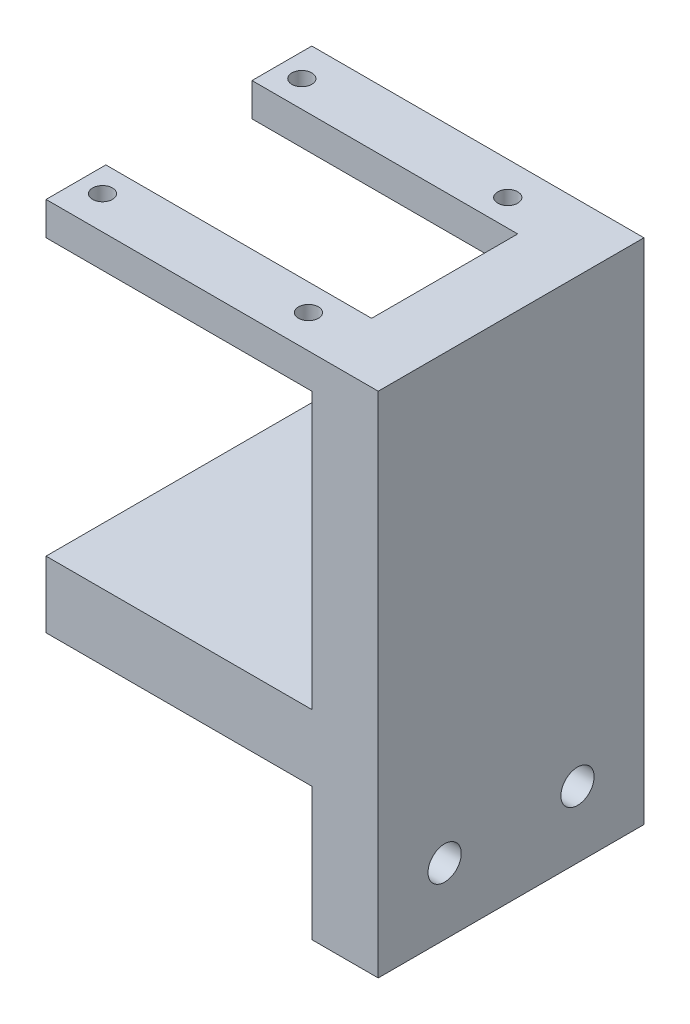
ISO-10303-21;
HEADER;
FILE_DESCRIPTION(('STEP AP214'),'2;1');
FILE_NAME('part.step','',(''),(''),'','','');
FILE_SCHEMA(('AUTOMOTIVE_DESIGN { 1 0 10303 214 1 1 1 1 }'));
ENDSEC;
DATA;
#1=APPLICATION_CONTEXT('core data for automotive mechanical design processes');
#2=APPLICATION_PROTOCOL_DEFINITION('international standard','automotive_design',2000,#1);
#3=PRODUCT_CONTEXT('',#1,'mechanical');
#4=PRODUCT('Part','Part','',(#3));
#5=PRODUCT_RELATED_PRODUCT_CATEGORY('part','',(#4));
#6=PRODUCT_DEFINITION_FORMATION('','',#4);
#7=PRODUCT_DEFINITION_CONTEXT('part definition',#1,'design');
#8=PRODUCT_DEFINITION('design','',#6,#7);
#9=PRODUCT_DEFINITION_SHAPE('','',#8);
#10=(LENGTH_UNIT() NAMED_UNIT(*) SI_UNIT(.MILLI.,.METRE.));
#11=(NAMED_UNIT(*) PLANE_ANGLE_UNIT() SI_UNIT($,.RADIAN.));
#12=(NAMED_UNIT(*) SI_UNIT($,.STERADIAN.) SOLID_ANGLE_UNIT());
#13=UNCERTAINTY_MEASURE_WITH_UNIT(LENGTH_MEASURE(1.E-05),#10,'distance_accuracy_value','');
#14=(GEOMETRIC_REPRESENTATION_CONTEXT(3) GLOBAL_UNCERTAINTY_ASSIGNED_CONTEXT((#13)) GLOBAL_UNIT_ASSIGNED_CONTEXT((#10,
#11,#12)) REPRESENTATION_CONTEXT('',''));
#15=CARTESIAN_POINT('',(0.,0.,0.));
#16=DIRECTION('',(0.,0.,1.));
#17=DIRECTION('',(1.,0.,0.));
#18=AXIS2_PLACEMENT_3D('',#15,#16,#17);
#19=CARTESIAN_POINT('',(0.,0.,0.));
#20=DIRECTION('',(1.,0.,0.));
#21=DIRECTION('',(0.,0.,-1.));
#22=AXIS2_PLACEMENT_3D('',#19,#20,#21);
#23=PLANE('',#22);
#24=DIRECTION('',(0.,0.,-1.));
#25=VECTOR('',#24,1.);
#26=CARTESIAN_POINT('',(0.,51.5,20.));
#27=LINE('',#26,#25);
#28=CARTESIAN_POINT('',(0.,51.5,20.));
#29=VERTEX_POINT('',#28);
#30=CARTESIAN_POINT('',(0.,51.5,11.));
#31=VERTEX_POINT('',#30);
#32=EDGE_CURVE('E64',#29,#31,#27,.T.);
#33=ORIENTED_EDGE('',*,*,#32,.T.);
#34=DIRECTION('',(0.,1.,0.));
#35=VECTOR('',#34,1.);
#36=CARTESIAN_POINT('',(0.,56.5,11.));
#37=LINE('',#36,#35);
#38=CARTESIAN_POINT('',(0.,56.5,11.));
#39=VERTEX_POINT('',#38);
#40=EDGE_CURVE('E184',#31,#39,#37,.T.);
#41=ORIENTED_EDGE('',*,*,#40,.T.);
#42=DIRECTION('',(0.,0.,-1.));
#43=VECTOR('',#42,1.);
#44=CARTESIAN_POINT('',(0.,56.5,0.));
#45=LINE('',#44,#43);
#46=CARTESIAN_POINT('',(0.,56.5,-11.));
#47=VERTEX_POINT('',#46);
#48=EDGE_CURVE('E308',#39,#47,#45,.T.);
#49=ORIENTED_EDGE('',*,*,#48,.T.);
#50=DIRECTION('',(0.,1.,0.));
#51=VECTOR('',#50,1.);
#52=CARTESIAN_POINT('',(0.,56.5,-11.));
#53=LINE('',#52,#51);
#54=CARTESIAN_POINT('',(0.,51.5,-11.));
#55=VERTEX_POINT('',#54);
#56=EDGE_CURVE('E72',#55,#47,#53,.T.);
#57=ORIENTED_EDGE('',*,*,#56,.F.);
#58=DIRECTION('',(0.,0.,1.));
#59=VECTOR('',#58,1.);
#60=CARTESIAN_POINT('',(0.,51.5,-20.));
#61=LINE('',#60,#59);
#62=CARTESIAN_POINT('',(0.,51.5,-20.));
#63=VERTEX_POINT('',#62);
#64=EDGE_CURVE('E208',#63,#55,#61,.T.);
#65=ORIENTED_EDGE('',*,*,#64,.F.);
#66=DIRECTION('',(0.,-1.,0.));
#67=VECTOR('',#66,1.);
#68=CARTESIAN_POINT('',(0.,0.,-20.));
#69=LINE('',#68,#67);
#70=CARTESIAN_POINT('',(0.,10.,-20.));
#71=VERTEX_POINT('',#70);
#72=EDGE_CURVE('E305',#63,#71,#69,.T.);
#73=ORIENTED_EDGE('',*,*,#72,.T.);
#74=DIRECTION('',(0.,0.,-1.));
#75=VECTOR('',#74,1.);
#76=CARTESIAN_POINT('',(0.,10.,-20.));
#77=LINE('',#76,#75);
#78=CARTESIAN_POINT('',(0.,10.,20.));
#79=VERTEX_POINT('',#78);
#80=EDGE_CURVE('E245',#79,#71,#77,.T.);
#81=ORIENTED_EDGE('',*,*,#80,.F.);
#82=DIRECTION('',(0.,-1.,0.));
#83=VECTOR('',#82,1.);
#84=CARTESIAN_POINT('',(0.,0.,20.));
#85=LINE('',#84,#83);
#86=EDGE_CURVE('E312',#29,#79,#85,.T.);
#87=ORIENTED_EDGE('',*,*,#86,.F.);
#88=EDGE_LOOP('',(#33,#41,#49,#57,#65,#73,#81,#87));
#89=FACE_BOUND('',#88,.T.);
#90=ADVANCED_FACE('F48',(#89),#23,.F.);
#91=CARTESIAN_POINT('',(0.,-10.,10.));
#92=DIRECTION('',(1.,0.,0.));
#93=DIRECTION('',(0.,0.,-1.));
#94=AXIS2_PLACEMENT_3D('',#91,#92,#93);
#95=CIRCLE('',#94,2.5);
#96=CARTESIAN_POINT('',(0.,-10.,7.5));
#97=VERTEX_POINT('',#96);
#98=EDGE_CURVE('E288',#97,#97,#95,.T.);
#99=ORIENTED_EDGE('',*,*,#98,.T.);
#100=EDGE_LOOP('',(#99));
#101=FACE_BOUND('',#100,.T.);
#102=CARTESIAN_POINT('',(0.,-10.,-10.));
#103=DIRECTION('',(1.,0.,0.));
#104=DIRECTION('',(0.,0.,-1.));
#105=AXIS2_PLACEMENT_3D('',#102,#103,#104);
#106=CIRCLE('',#105,2.5);
#107=CARTESIAN_POINT('',(0.,-10.,-12.5));
#108=VERTEX_POINT('',#107);
#109=EDGE_CURVE('E319',#108,#108,#106,.T.);
#110=ORIENTED_EDGE('',*,*,#109,.T.);
#111=EDGE_LOOP('',(#110));
#112=FACE_BOUND('',#111,.T.);
#113=DIRECTION('',(0.,0.,1.));
#114=VECTOR('',#113,1.);
#115=CARTESIAN_POINT('',(0.,0.,-20.));
#116=LINE('',#115,#114);
#117=CARTESIAN_POINT('',(0.,0.,-20.));
#118=VERTEX_POINT('',#117);
#119=CARTESIAN_POINT('',(0.,0.,20.));
#120=VERTEX_POINT('',#119);
#121=EDGE_CURVE('E251',#118,#120,#116,.T.);
#122=ORIENTED_EDGE('',*,*,#121,.F.);
#123=CARTESIAN_POINT('',(0.,-20.,-20.));
#124=VERTEX_POINT('',#123);
#125=EDGE_CURVE('E282',#118,#124,#69,.T.);
#126=ORIENTED_EDGE('',*,*,#125,.T.);
#127=DIRECTION('',(0.,0.,-1.));
#128=VECTOR('',#127,1.);
#129=CARTESIAN_POINT('',(0.,-20.,0.));
#130=LINE('',#129,#128);
#131=CARTESIAN_POINT('',(0.,-20.,20.));
#132=VERTEX_POINT('',#131);
#133=EDGE_CURVE('E315',#132,#124,#130,.T.);
#134=ORIENTED_EDGE('',*,*,#133,.F.);
#135=EDGE_CURVE('E311',#120,#132,#85,.T.);
#136=ORIENTED_EDGE('',*,*,#135,.F.);
#137=EDGE_LOOP('',(#122,#126,#134,#136));
#138=FACE_BOUND('',#137,.T.);
#139=ADVANCED_FACE('F337',(#101,#112,#138),#23,.F.);
#140=CARTESIAN_POINT('',(10.,0.,-20.));
#141=DIRECTION('',(0.,0.,-1.));
#142=DIRECTION('',(0.,1.,0.));
#143=AXIS2_PLACEMENT_3D('',#140,#141,#142);
#144=PLANE('',#143);
#145=ORIENTED_EDGE('',*,*,#72,.F.);
#146=DIRECTION('',(1.,0.,0.));
#147=VECTOR('',#146,1.);
#148=CARTESIAN_POINT('',(-40.,51.5,-20.));
#149=LINE('',#148,#147);
#150=CARTESIAN_POINT('',(-40.,51.5,-20.));
#151=VERTEX_POINT('',#150);
#152=EDGE_CURVE('E241',#151,#63,#149,.T.);
#153=ORIENTED_EDGE('',*,*,#152,.F.);
#154=DIRECTION('',(0.,-1.,0.));
#155=VECTOR('',#154,1.);
#156=CARTESIAN_POINT('',(-40.,56.5,-20.));
#157=LINE('',#156,#155);
#158=CARTESIAN_POINT('',(-40.,56.5,-20.));
#159=VERTEX_POINT('',#158);
#160=EDGE_CURVE('E215',#159,#151,#157,.T.);
#161=ORIENTED_EDGE('',*,*,#160,.F.);
#162=DIRECTION('',(-1.,0.,0.));
#163=VECTOR('',#162,1.);
#164=CARTESIAN_POINT('',(10.,56.5,-20.));
#165=LINE('',#164,#163);
#166=CARTESIAN_POINT('',(10.,56.5,-20.));
#167=VERTEX_POINT('',#166);
#168=EDGE_CURVE('E11',#167,#159,#165,.T.);
#169=ORIENTED_EDGE('',*,*,#168,.F.);
#170=DIRECTION('',(0.,-1.,0.));
#171=VECTOR('',#170,1.);
#172=CARTESIAN_POINT('',(10.,0.,-20.));
#173=LINE('',#172,#171);
#174=CARTESIAN_POINT('',(10.,-20.,-20.));
#175=VERTEX_POINT('',#174);
#176=EDGE_CURVE('E283',#167,#175,#173,.T.);
#177=ORIENTED_EDGE('',*,*,#176,.T.);
#178=DIRECTION('',(-1.,0.,0.));
#179=VECTOR('',#178,1.);
#180=CARTESIAN_POINT('',(10.,-20.,-20.));
#181=LINE('',#180,#179);
#182=EDGE_CURVE('E304',#175,#124,#181,.T.);
#183=ORIENTED_EDGE('',*,*,#182,.T.);
#184=ORIENTED_EDGE('',*,*,#125,.F.);
#185=DIRECTION('',(1.,0.,0.));
#186=VECTOR('',#185,1.);
#187=CARTESIAN_POINT('',(-40.,0.,-20.));
#188=LINE('',#187,#186);
#189=CARTESIAN_POINT('',(-40.,0.,-20.));
#190=VERTEX_POINT('',#189);
#191=EDGE_CURVE('E270',#190,#118,#188,.T.);
#192=ORIENTED_EDGE('',*,*,#191,.F.);
#193=DIRECTION('',(0.,-1.,0.));
#194=VECTOR('',#193,1.);
#195=CARTESIAN_POINT('',(-40.,10.,-20.));
#196=LINE('',#195,#194);
#197=CARTESIAN_POINT('',(-40.,10.,-20.));
#198=VERTEX_POINT('',#197);
#199=EDGE_CURVE('E254',#198,#190,#196,.T.);
#200=ORIENTED_EDGE('',*,*,#199,.F.);
#201=DIRECTION('',(1.,0.,0.));
#202=VECTOR('',#201,1.);
#203=CARTESIAN_POINT('',(-40.,10.,-20.));
#204=LINE('',#203,#202);
#205=EDGE_CURVE('E274',#198,#71,#204,.T.);
#206=ORIENTED_EDGE('',*,*,#205,.T.);
#207=EDGE_LOOP('',(#145,#153,#161,#169,#177,#183,#184,#192,#200,#206));
#208=FACE_BOUND('',#207,.T.);
#209=ADVANCED_FACE('F50',(#208),#144,.T.);
#210=CARTESIAN_POINT('',(10.,56.5,0.));
#211=DIRECTION('',(0.,1.,0.));
#212=DIRECTION('',(0.,0.,1.));
#213=AXIS2_PLACEMENT_3D('',#210,#211,#212);
#214=PLANE('',#213);
#215=CARTESIAN_POINT('',(-36.5,56.5,15.));
#216=DIRECTION('',(0.,-1.,0.));
#217=DIRECTION('',(0.,0.,-1.));
#218=AXIS2_PLACEMENT_3D('',#215,#216,#217);
#219=CIRCLE('',#218,1.5);
#220=CARTESIAN_POINT('',(-36.5,56.5,13.5));
#221=VERTEX_POINT('',#220);
#222=EDGE_CURVE('E412',#221,#221,#219,.T.);
#223=ORIENTED_EDGE('',*,*,#222,.T.);
#224=EDGE_LOOP('',(#223));
#225=FACE_BOUND('',#224,.T.);
#226=CARTESIAN_POINT('',(-5.5,56.5,15.));
#227=DIRECTION('',(0.,-1.,0.));
#228=DIRECTION('',(0.,0.,-1.));
#229=AXIS2_PLACEMENT_3D('',#226,#227,#228);
#230=CIRCLE('',#229,1.5);
#231=CARTESIAN_POINT('',(-5.5,56.5,13.5));
#232=VERTEX_POINT('',#231);
#233=EDGE_CURVE('E416',#232,#232,#230,.T.);
#234=ORIENTED_EDGE('',*,*,#233,.T.);
#235=EDGE_LOOP('',(#234));
#236=FACE_BOUND('',#235,.T.);
#237=CARTESIAN_POINT('',(-36.5,56.5,-15.));
#238=DIRECTION('',(0.,1.,0.));
#239=DIRECTION('',(0.,0.,1.));
#240=AXIS2_PLACEMENT_3D('',#237,#238,#239);
#241=CIRCLE('',#240,1.5);
#242=CARTESIAN_POINT('',(-36.5,56.5,-13.5));
#243=VERTEX_POINT('',#242);
#244=EDGE_CURVE('E203',#243,#243,#241,.T.);
#245=ORIENTED_EDGE('',*,*,#244,.F.);
#246=EDGE_LOOP('',(#245));
#247=FACE_BOUND('',#246,.T.);
#248=CARTESIAN_POINT('',(-5.5,56.5,-15.));
#249=DIRECTION('',(0.,1.,0.));
#250=DIRECTION('',(0.,0.,1.));
#251=AXIS2_PLACEMENT_3D('',#248,#249,#250);
#252=CIRCLE('',#251,1.5);
#253=CARTESIAN_POINT('',(-5.5,56.5,-13.5));
#254=VERTEX_POINT('',#253);
#255=EDGE_CURVE('E198',#254,#254,#252,.T.);
#256=ORIENTED_EDGE('',*,*,#255,.F.);
#257=EDGE_LOOP('',(#256));
#258=FACE_BOUND('',#257,.T.);
#259=ORIENTED_EDGE('',*,*,#48,.F.);
#260=DIRECTION('',(1.,0.,0.));
#261=VECTOR('',#260,1.);
#262=CARTESIAN_POINT('',(-40.,56.5,11.));
#263=LINE('',#262,#261);
#264=CARTESIAN_POINT('',(-40.,56.5,11.));
#265=VERTEX_POINT('',#264);
#266=EDGE_CURVE('E173',#265,#39,#263,.T.);
#267=ORIENTED_EDGE('',*,*,#266,.F.);
#268=DIRECTION('',(0.,0.,1.));
#269=VECTOR('',#268,1.);
#270=CARTESIAN_POINT('',(-40.,56.5,20.));
#271=LINE('',#270,#269);
#272=CARTESIAN_POINT('',(-40.,56.5,20.));
#273=VERTEX_POINT('',#272);
#274=EDGE_CURVE('E165',#265,#273,#271,.T.);
#275=ORIENTED_EDGE('',*,*,#274,.T.);
#276=DIRECTION('',(-1.,0.,0.));
#277=VECTOR('',#276,1.);
#278=CARTESIAN_POINT('',(10.,56.5,20.));
#279=LINE('',#278,#277);
#280=CARTESIAN_POINT('',(10.,56.5,20.));
#281=VERTEX_POINT('',#280);
#282=EDGE_CURVE('E57',#281,#273,#279,.T.);
#283=ORIENTED_EDGE('',*,*,#282,.F.);
#284=DIRECTION('',(0.,0.,-1.));
#285=VECTOR('',#284,1.);
#286=CARTESIAN_POINT('',(10.,56.5,0.));
#287=LINE('',#286,#285);
#288=EDGE_CURVE('E287',#281,#167,#287,.T.);
#289=ORIENTED_EDGE('',*,*,#288,.T.);
#290=ORIENTED_EDGE('',*,*,#168,.T.);
#291=DIRECTION('',(0.,0.,-1.));
#292=VECTOR('',#291,1.);
#293=CARTESIAN_POINT('',(-40.,56.5,-20.));
#294=LINE('',#293,#292);
#295=CARTESIAN_POINT('',(-40.,56.5,-11.));
#296=VERTEX_POINT('',#295);
#297=EDGE_CURVE('E225',#296,#159,#294,.T.);
#298=ORIENTED_EDGE('',*,*,#297,.F.);
#299=DIRECTION('',(1.,0.,0.));
#300=VECTOR('',#299,1.);
#301=CARTESIAN_POINT('',(-40.,56.5,-11.));
#302=LINE('',#301,#300);
#303=EDGE_CURVE('E229',#296,#47,#302,.T.);
#304=ORIENTED_EDGE('',*,*,#303,.T.);
#305=EDGE_LOOP('',(#259,#267,#275,#283,#289,#290,#298,#304));
#306=FACE_BOUND('',#305,.T.);
#307=ADVANCED_FACE('F172',(#225,#236,#247,#258,#306),#214,.T.);
#308=CARTESIAN_POINT('',(10.,0.,20.));
#309=DIRECTION('',(0.,0.,-1.));
#310=DIRECTION('',(0.,1.,0.));
#311=AXIS2_PLACEMENT_3D('',#308,#309,#310);
#312=PLANE('',#311);
#313=ORIENTED_EDGE('',*,*,#282,.T.);
#314=DIRECTION('',(0.,-1.,0.));
#315=VECTOR('',#314,1.);
#316=CARTESIAN_POINT('',(-40.,56.5,20.));
#317=LINE('',#316,#315);
#318=CARTESIAN_POINT('',(-40.,51.5,20.));
#319=VERTEX_POINT('',#318);
#320=EDGE_CURVE('E151',#273,#319,#317,.T.);
#321=ORIENTED_EDGE('',*,*,#320,.T.);
#322=DIRECTION('',(1.,0.,0.));
#323=VECTOR('',#322,1.);
#324=CARTESIAN_POINT('',(-40.,51.5,20.));
#325=LINE('',#324,#323);
#326=EDGE_CURVE('E183',#319,#29,#325,.T.);
#327=ORIENTED_EDGE('',*,*,#326,.T.);
#328=ORIENTED_EDGE('',*,*,#86,.T.);
#329=DIRECTION('',(1.,0.,0.));
#330=VECTOR('',#329,1.);
#331=CARTESIAN_POINT('',(-40.,10.,20.));
#332=LINE('',#331,#330);
#333=CARTESIAN_POINT('',(-40.,10.,20.));
#334=VERTEX_POINT('',#333);
#335=EDGE_CURVE('E278',#334,#79,#332,.T.);
#336=ORIENTED_EDGE('',*,*,#335,.F.);
#337=DIRECTION('',(0.,1.,0.));
#338=VECTOR('',#337,1.);
#339=CARTESIAN_POINT('',(-40.,10.,20.));
#340=LINE('',#339,#338);
#341=CARTESIAN_POINT('',(-40.,0.,20.));
#342=VERTEX_POINT('',#341);
#343=EDGE_CURVE('E246',#342,#334,#340,.T.);
#344=ORIENTED_EDGE('',*,*,#343,.F.);
#345=DIRECTION('',(1.,0.,0.));
#346=VECTOR('',#345,1.);
#347=CARTESIAN_POINT('',(-40.,0.,20.));
#348=LINE('',#347,#346);
#349=EDGE_CURVE('E260',#342,#120,#348,.T.);
#350=ORIENTED_EDGE('',*,*,#349,.T.);
#351=ORIENTED_EDGE('',*,*,#135,.T.);
#352=DIRECTION('',(-1.,0.,0.));
#353=VECTOR('',#352,1.);
#354=CARTESIAN_POINT('',(10.,-20.,20.));
#355=LINE('',#354,#353);
#356=CARTESIAN_POINT('',(10.,-20.,20.));
#357=VERTEX_POINT('',#356);
#358=EDGE_CURVE('E160',#357,#132,#355,.T.);
#359=ORIENTED_EDGE('',*,*,#358,.F.);
#360=DIRECTION('',(0.,-1.,0.));
#361=VECTOR('',#360,1.);
#362=CARTESIAN_POINT('',(10.,0.,20.));
#363=LINE('',#362,#361);
#364=EDGE_CURVE('E154',#281,#357,#363,.T.);
#365=ORIENTED_EDGE('',*,*,#364,.F.);
#366=EDGE_LOOP('',(#313,#321,#327,#328,#336,#344,#350,#351,#359,#365));
#367=FACE_BOUND('',#366,.T.);
#368=ADVANCED_FACE('F150',(#367),#312,.F.);
#369=CARTESIAN_POINT('',(10.,-10.,-10.));
#370=DIRECTION('',(-1.,0.,0.));
#371=DIRECTION('',(0.,0.,1.));
#372=AXIS2_PLACEMENT_3D('',#369,#370,#371);
#373=CYLINDRICAL_SURFACE('',#372,2.5);
#374=CARTESIAN_POINT('',(10.,-10.,-10.));
#375=DIRECTION('',(1.,0.,0.));
#376=DIRECTION('',(0.,0.,-1.));
#377=AXIS2_PLACEMENT_3D('',#374,#375,#376);
#378=CIRCLE('',#377,2.5);
#379=CARTESIAN_POINT('',(10.,-10.,-12.5));
#380=VERTEX_POINT('',#379);
#381=EDGE_CURVE('E296',#380,#380,#378,.T.);
#382=ORIENTED_EDGE('',*,*,#381,.T.);
#383=EDGE_LOOP('',(#382));
#384=FACE_BOUND('',#383,.T.);
#385=ORIENTED_EDGE('',*,*,#109,.F.);
#386=EDGE_LOOP('',(#385));
#387=FACE_BOUND('',#386,.T.);
#388=ADVANCED_FACE('F397',(#384,#387),#373,.F.);
#389=CARTESIAN_POINT('',(10.,-20.,0.));
#390=DIRECTION('',(0.,1.,0.));
#391=DIRECTION('',(0.,0.,1.));
#392=AXIS2_PLACEMENT_3D('',#389,#390,#391);
#393=PLANE('',#392);
#394=ORIENTED_EDGE('',*,*,#133,.T.);
#395=ORIENTED_EDGE('',*,*,#182,.F.);
#396=DIRECTION('',(0.,0.,-1.));
#397=VECTOR('',#396,1.);
#398=CARTESIAN_POINT('',(10.,-20.,0.));
#399=LINE('',#398,#397);
#400=EDGE_CURVE('E293',#357,#175,#399,.T.);
#401=ORIENTED_EDGE('',*,*,#400,.F.);
#402=ORIENTED_EDGE('',*,*,#358,.T.);
#403=EDGE_LOOP('',(#394,#395,#401,#402));
#404=FACE_BOUND('',#403,.T.);
#405=ADVANCED_FACE('F334',(#404),#393,.F.);
#406=CARTESIAN_POINT('',(10.,-10.,10.));
#407=DIRECTION('',(-1.,0.,0.));
#408=DIRECTION('',(0.,0.,1.));
#409=AXIS2_PLACEMENT_3D('',#406,#407,#408);
#410=CYLINDRICAL_SURFACE('',#409,2.5);
#411=CARTESIAN_POINT('',(10.,-10.,10.));
#412=DIRECTION('',(1.,0.,0.));
#413=DIRECTION('',(0.,0.,-1.));
#414=AXIS2_PLACEMENT_3D('',#411,#412,#413);
#415=CIRCLE('',#414,2.5);
#416=CARTESIAN_POINT('',(10.,-10.,7.5));
#417=VERTEX_POINT('',#416);
#418=EDGE_CURVE('E300',#417,#417,#415,.T.);
#419=ORIENTED_EDGE('',*,*,#418,.T.);
#420=EDGE_LOOP('',(#419));
#421=FACE_BOUND('',#420,.T.);
#422=ORIENTED_EDGE('',*,*,#98,.F.);
#423=EDGE_LOOP('',(#422));
#424=FACE_BOUND('',#423,.T.);
#425=ADVANCED_FACE('F393',(#421,#424),#410,.F.);
#426=CARTESIAN_POINT('',(10.,0.,0.));
#427=DIRECTION('',(1.,0.,0.));
#428=DIRECTION('',(0.,0.,-1.));
#429=AXIS2_PLACEMENT_3D('',#426,#427,#428);
#430=PLANE('',#429);
#431=ORIENTED_EDGE('',*,*,#176,.F.);
#432=ORIENTED_EDGE('',*,*,#288,.F.);
#433=ORIENTED_EDGE('',*,*,#364,.T.);
#434=ORIENTED_EDGE('',*,*,#400,.T.);
#435=EDGE_LOOP('',(#431,#432,#433,#434));
#436=FACE_BOUND('',#435,.T.);
#437=ORIENTED_EDGE('',*,*,#381,.F.);
#438=EDGE_LOOP('',(#437));
#439=FACE_BOUND('',#438,.T.);
#440=ORIENTED_EDGE('',*,*,#418,.F.);
#441=EDGE_LOOP('',(#440));
#442=FACE_BOUND('',#441,.T.);
#443=ADVANCED_FACE('F346',(#436,#439,#442),#430,.T.);
#444=CARTESIAN_POINT('',(-40.,10.,-20.));
#445=DIRECTION('',(0.,-1.,0.));
#446=DIRECTION('',(0.,0.,-1.));
#447=AXIS2_PLACEMENT_3D('',#444,#445,#446);
#448=PLANE('',#447);
#449=ORIENTED_EDGE('',*,*,#80,.T.);
#450=ORIENTED_EDGE('',*,*,#205,.F.);
#451=DIRECTION('',(0.,0.,-1.));
#452=VECTOR('',#451,1.);
#453=CARTESIAN_POINT('',(-40.,10.,-20.));
#454=LINE('',#453,#452);
#455=EDGE_CURVE('E250',#334,#198,#454,.T.);
#456=ORIENTED_EDGE('',*,*,#455,.F.);
#457=ORIENTED_EDGE('',*,*,#335,.T.);
#458=EDGE_LOOP('',(#449,#450,#456,#457));
#459=FACE_BOUND('',#458,.T.);
#460=ADVANCED_FACE('F368',(#459),#448,.F.);
#461=CARTESIAN_POINT('',(-40.,0.,-20.));
#462=DIRECTION('',(0.,1.,0.));
#463=DIRECTION('',(0.,0.,1.));
#464=AXIS2_PLACEMENT_3D('',#461,#462,#463);
#465=PLANE('',#464);
#466=ORIENTED_EDGE('',*,*,#121,.T.);
#467=ORIENTED_EDGE('',*,*,#349,.F.);
#468=DIRECTION('',(0.,0.,1.));
#469=VECTOR('',#468,1.);
#470=CARTESIAN_POINT('',(-40.,0.,-20.));
#471=LINE('',#470,#469);
#472=EDGE_CURVE('E257',#190,#342,#471,.T.);
#473=ORIENTED_EDGE('',*,*,#472,.F.);
#474=ORIENTED_EDGE('',*,*,#191,.T.);
#475=EDGE_LOOP('',(#466,#467,#473,#474));
#476=FACE_BOUND('',#475,.T.);
#477=ADVANCED_FACE('F376',(#476),#465,.F.);
#478=CARTESIAN_POINT('',(-40.,0.,0.));
#479=DIRECTION('',(-1.,0.,0.));
#480=DIRECTION('',(0.,0.,1.));
#481=AXIS2_PLACEMENT_3D('',#478,#479,#480);
#482=PLANE('',#481);
#483=ORIENTED_EDGE('',*,*,#343,.T.);
#484=ORIENTED_EDGE('',*,*,#455,.T.);
#485=ORIENTED_EDGE('',*,*,#199,.T.);
#486=ORIENTED_EDGE('',*,*,#472,.T.);
#487=EDGE_LOOP('',(#483,#484,#485,#486));
#488=FACE_BOUND('',#487,.T.);
#489=ADVANCED_FACE('F372',(#488),#482,.T.);
#490=CARTESIAN_POINT('',(-40.,51.5,-20.));
#491=DIRECTION('',(0.,1.,0.));
#492=DIRECTION('',(0.,0.,1.));
#493=AXIS2_PLACEMENT_3D('',#490,#491,#492);
#494=PLANE('',#493);
#495=CARTESIAN_POINT('',(-36.5,51.5,-15.));
#496=DIRECTION('',(0.,1.,0.));
#497=DIRECTION('',(0.,0.,1.));
#498=AXIS2_PLACEMENT_3D('',#495,#496,#497);
#499=CIRCLE('',#498,1.5);
#500=CARTESIAN_POINT('',(-36.5,51.5,-13.5));
#501=VERTEX_POINT('',#500);
#502=EDGE_CURVE('E199',#501,#501,#499,.F.);
#503=ORIENTED_EDGE('',*,*,#502,.F.);
#504=EDGE_LOOP('',(#503));
#505=FACE_BOUND('',#504,.T.);
#506=CARTESIAN_POINT('',(-5.5,51.5,-15.));
#507=DIRECTION('',(0.,1.,0.));
#508=DIRECTION('',(0.,0.,1.));
#509=AXIS2_PLACEMENT_3D('',#506,#507,#508);
#510=CIRCLE('',#509,1.5);
#511=CARTESIAN_POINT('',(-5.5,51.5,-13.5));
#512=VERTEX_POINT('',#511);
#513=EDGE_CURVE('E204',#512,#512,#510,.F.);
#514=ORIENTED_EDGE('',*,*,#513,.F.);
#515=EDGE_LOOP('',(#514));
#516=FACE_BOUND('',#515,.T.);
#517=ORIENTED_EDGE('',*,*,#64,.T.);
#518=DIRECTION('',(1.,0.,0.));
#519=VECTOR('',#518,1.);
#520=CARTESIAN_POINT('',(-40.,51.5,-11.));
#521=LINE('',#520,#519);
#522=CARTESIAN_POINT('',(-40.,51.5,-11.));
#523=VERTEX_POINT('',#522);
#524=EDGE_CURVE('E237',#523,#55,#521,.T.);
#525=ORIENTED_EDGE('',*,*,#524,.F.);
#526=DIRECTION('',(0.,0.,1.));
#527=VECTOR('',#526,1.);
#528=CARTESIAN_POINT('',(-40.,51.5,-20.));
#529=LINE('',#528,#527);
#530=EDGE_CURVE('E219',#151,#523,#529,.T.);
#531=ORIENTED_EDGE('',*,*,#530,.F.);
#532=ORIENTED_EDGE('',*,*,#152,.T.);
#533=EDGE_LOOP('',(#517,#525,#531,#532));
#534=FACE_BOUND('',#533,.T.);
#535=ADVANCED_FACE('F355',(#505,#516,#534),#494,.F.);
#536=CARTESIAN_POINT('',(-40.,56.5,-11.));
#537=DIRECTION('',(0.,0.,-1.));
#538=DIRECTION('',(-1.,0.,0.));
#539=AXIS2_PLACEMENT_3D('',#536,#537,#538);
#540=PLANE('',#539);
#541=ORIENTED_EDGE('',*,*,#56,.T.);
#542=ORIENTED_EDGE('',*,*,#303,.F.);
#543=DIRECTION('',(0.,1.,0.));
#544=VECTOR('',#543,1.);
#545=CARTESIAN_POINT('',(-40.,56.5,-11.));
#546=LINE('',#545,#544);
#547=EDGE_CURVE('E222',#523,#296,#546,.T.);
#548=ORIENTED_EDGE('',*,*,#547,.F.);
#549=ORIENTED_EDGE('',*,*,#524,.T.);
#550=EDGE_LOOP('',(#541,#542,#548,#549));
#551=FACE_BOUND('',#550,.T.);
#552=ADVANCED_FACE('F358',(#551),#540,.F.);
#553=CARTESIAN_POINT('',(-40.,0.,0.));
#554=DIRECTION('',(-1.,0.,0.));
#555=DIRECTION('',(0.,0.,1.));
#556=AXIS2_PLACEMENT_3D('',#553,#554,#555);
#557=PLANE('',#556);
#558=ORIENTED_EDGE('',*,*,#160,.T.);
#559=ORIENTED_EDGE('',*,*,#530,.T.);
#560=ORIENTED_EDGE('',*,*,#547,.T.);
#561=ORIENTED_EDGE('',*,*,#297,.T.);
#562=EDGE_LOOP('',(#558,#559,#560,#561));
#563=FACE_BOUND('',#562,.T.);
#564=ADVANCED_FACE('F350',(#563),#557,.T.);
#565=CARTESIAN_POINT('',(-5.5,-20.001,-15.));
#566=DIRECTION('',(0.,1.,0.));
#567=DIRECTION('',(0.,0.,1.));
#568=AXIS2_PLACEMENT_3D('',#565,#566,#567);
#569=CYLINDRICAL_SURFACE('',#568,1.5);
#570=ORIENTED_EDGE('',*,*,#255,.T.);
#571=EDGE_LOOP('',(#570));
#572=FACE_BOUND('',#571,.T.);
#573=ORIENTED_EDGE('',*,*,#513,.T.);
#574=EDGE_LOOP('',(#573));
#575=FACE_BOUND('',#574,.T.);
#576=ADVANCED_FACE('F421',(#572,#575),#569,.F.);
#577=CARTESIAN_POINT('',(-36.5,-20.001,-15.));
#578=DIRECTION('',(0.,1.,0.));
#579=DIRECTION('',(0.,0.,1.));
#580=AXIS2_PLACEMENT_3D('',#577,#578,#579);
#581=CYLINDRICAL_SURFACE('',#580,1.5);
#582=ORIENTED_EDGE('',*,*,#244,.T.);
#583=EDGE_LOOP('',(#582));
#584=FACE_BOUND('',#583,.T.);
#585=ORIENTED_EDGE('',*,*,#502,.T.);
#586=EDGE_LOOP('',(#585));
#587=FACE_BOUND('',#586,.T.);
#588=ADVANCED_FACE('F424',(#584,#587),#581,.F.);
#589=CARTESIAN_POINT('',(-40.,56.5,11.));
#590=DIRECTION('',(0.,0.,-1.));
#591=DIRECTION('',(-1.,0.,0.));
#592=AXIS2_PLACEMENT_3D('',#589,#590,#591);
#593=PLANE('',#592);
#594=ORIENTED_EDGE('',*,*,#40,.F.);
#595=DIRECTION('',(1.,0.,0.));
#596=VECTOR('',#595,1.);
#597=CARTESIAN_POINT('',(-40.,51.5,11.));
#598=LINE('',#597,#596);
#599=CARTESIAN_POINT('',(-40.,51.5,11.));
#600=VERTEX_POINT('',#599);
#601=EDGE_CURVE('E193',#600,#31,#598,.T.);
#602=ORIENTED_EDGE('',*,*,#601,.F.);
#603=DIRECTION('',(0.,1.,0.));
#604=VECTOR('',#603,1.);
#605=CARTESIAN_POINT('',(-40.,56.5,11.));
#606=LINE('',#605,#604);
#607=EDGE_CURVE('E175',#600,#265,#606,.T.);
#608=ORIENTED_EDGE('',*,*,#607,.T.);
#609=ORIENTED_EDGE('',*,*,#266,.T.);
#610=EDGE_LOOP('',(#594,#602,#608,#609));
#611=FACE_BOUND('',#610,.T.);
#612=ADVANCED_FACE('F362',(#611),#593,.T.);
#613=CARTESIAN_POINT('',(-40.,51.5,20.));
#614=DIRECTION('',(0.,-1.,0.));
#615=DIRECTION('',(0.,0.,-1.));
#616=AXIS2_PLACEMENT_3D('',#613,#614,#615);
#617=PLANE('',#616);
#618=CARTESIAN_POINT('',(-36.5,51.5,15.));
#619=DIRECTION('',(0.,-1.,0.));
#620=DIRECTION('',(0.,0.,-1.));
#621=AXIS2_PLACEMENT_3D('',#618,#619,#620);
#622=CIRCLE('',#621,1.5);
#623=CARTESIAN_POINT('',(-36.5,51.5,13.5));
#624=VERTEX_POINT('',#623);
#625=EDGE_CURVE('E188',#624,#624,#622,.T.);
#626=ORIENTED_EDGE('',*,*,#625,.F.);
#627=EDGE_LOOP('',(#626));
#628=FACE_BOUND('',#627,.T.);
#629=CARTESIAN_POINT('',(-5.5,51.5,15.));
#630=DIRECTION('',(0.,-1.,0.));
#631=DIRECTION('',(0.,0.,-1.));
#632=AXIS2_PLACEMENT_3D('',#629,#630,#631);
#633=CIRCLE('',#632,1.5);
#634=CARTESIAN_POINT('',(-5.5,51.5,13.5));
#635=VERTEX_POINT('',#634);
#636=EDGE_CURVE('E462',#635,#635,#633,.T.);
#637=ORIENTED_EDGE('',*,*,#636,.F.);
#638=EDGE_LOOP('',(#637));
#639=FACE_BOUND('',#638,.T.);
#640=ORIENTED_EDGE('',*,*,#32,.F.);
#641=ORIENTED_EDGE('',*,*,#326,.F.);
#642=DIRECTION('',(0.,0.,-1.));
#643=VECTOR('',#642,1.);
#644=CARTESIAN_POINT('',(-40.,51.5,20.));
#645=LINE('',#644,#643);
#646=EDGE_CURVE('E168',#319,#600,#645,.T.);
#647=ORIENTED_EDGE('',*,*,#646,.T.);
#648=ORIENTED_EDGE('',*,*,#601,.T.);
#649=EDGE_LOOP('',(#640,#641,#647,#648));
#650=FACE_BOUND('',#649,.T.);
#651=ADVANCED_FACE('F363',(#628,#639,#650),#617,.T.);
#652=CARTESIAN_POINT('',(-40.,0.,0.));
#653=DIRECTION('',(-1.,0.,0.));
#654=DIRECTION('',(0.,0.,-1.));
#655=AXIS2_PLACEMENT_3D('',#652,#653,#654);
#656=PLANE('',#655);
#657=ORIENTED_EDGE('',*,*,#320,.F.);
#658=ORIENTED_EDGE('',*,*,#274,.F.);
#659=ORIENTED_EDGE('',*,*,#607,.F.);
#660=ORIENTED_EDGE('',*,*,#646,.F.);
#661=EDGE_LOOP('',(#657,#658,#659,#660));
#662=FACE_BOUND('',#661,.T.);
#663=ADVANCED_FACE('F163',(#662),#656,.T.);
#664=CARTESIAN_POINT('',(-5.5,-20.001,15.));
#665=DIRECTION('',(0.,1.,0.));
#666=DIRECTION('',(0.,0.,1.));
#667=AXIS2_PLACEMENT_3D('',#664,#665,#666);
#668=CYLINDRICAL_SURFACE('',#667,1.5);
#669=ORIENTED_EDGE('',*,*,#636,.T.);
#670=EDGE_LOOP('',(#669));
#671=FACE_BOUND('',#670,.T.);
#672=ORIENTED_EDGE('',*,*,#233,.F.);
#673=EDGE_LOOP('',(#672));
#674=FACE_BOUND('',#673,.T.);
#675=ADVANCED_FACE('F449',(#671,#674),#668,.F.);
#676=CARTESIAN_POINT('',(-36.5,-20.001,15.));
#677=DIRECTION('',(0.,1.,0.));
#678=DIRECTION('',(0.,0.,1.));
#679=AXIS2_PLACEMENT_3D('',#676,#677,#678);
#680=CYLINDRICAL_SURFACE('',#679,1.5);
#681=ORIENTED_EDGE('',*,*,#625,.T.);
#682=EDGE_LOOP('',(#681));
#683=FACE_BOUND('',#682,.T.);
#684=ORIENTED_EDGE('',*,*,#222,.F.);
#685=EDGE_LOOP('',(#684));
#686=FACE_BOUND('',#685,.T.);
#687=ADVANCED_FACE('F452',(#683,#686),#680,.F.);
#688=CLOSED_SHELL('',(#90,#139,#209,#307,#368,#388,#405,#425,#443,#460,#477,#489,#535,#552,#564,
#576,#588,#612,#651,#663,#675,#687));
#689=MANIFOLD_SOLID_BREP('B2',#688);
#690=ADVANCED_BREP_SHAPE_REPRESENTATION('',(#18,#689),#14);
#691=SHAPE_DEFINITION_REPRESENTATION(#9,#690);
ENDSEC;
END-ISO-10303-21;
